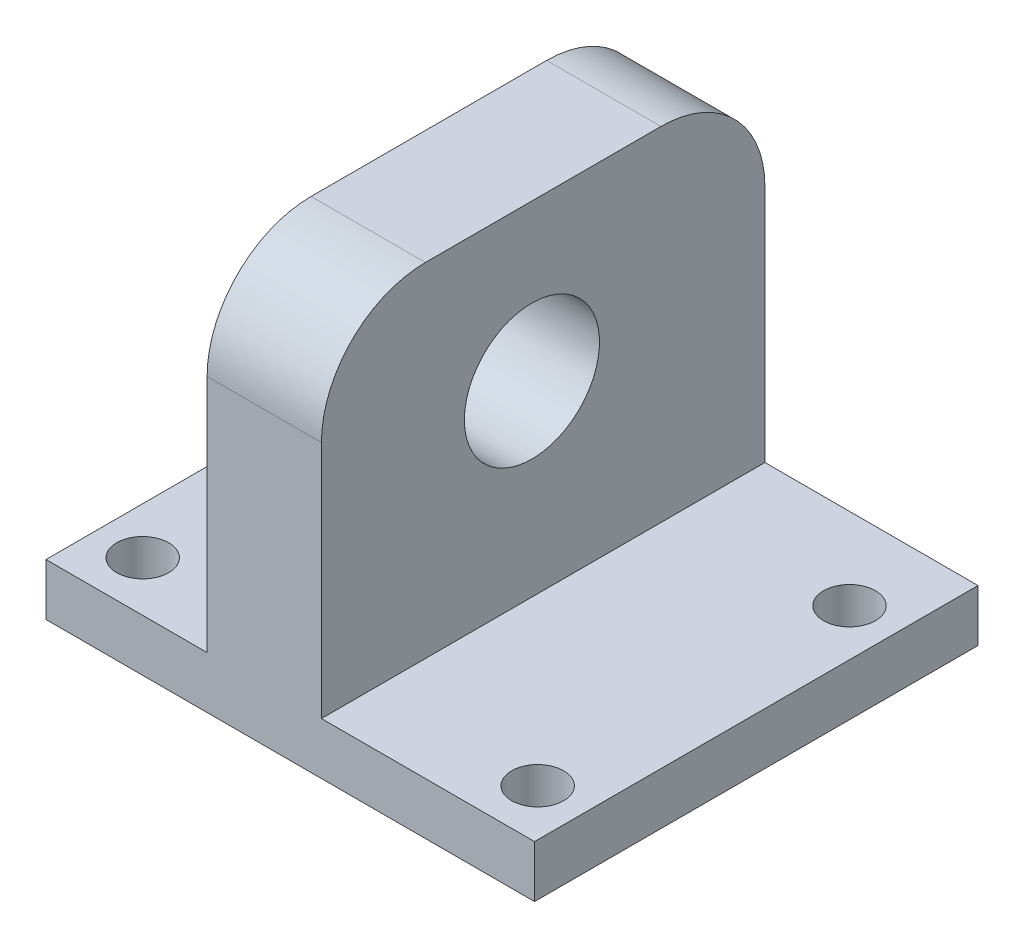
ISO-10303-21;
HEADER;
FILE_DESCRIPTION(('STEP AP214'),'2;1');
FILE_NAME('part.step','',(''),(''),'','','');
FILE_SCHEMA(('AUTOMOTIVE_DESIGN { 1 0 10303 214 1 1 1 1 }'));
ENDSEC;
DATA;
#1=APPLICATION_CONTEXT('core data for automotive mechanical design processes');
#2=APPLICATION_PROTOCOL_DEFINITION('international standard','automotive_design',2000,#1);
#3=PRODUCT_CONTEXT('',#1,'mechanical');
#4=PRODUCT('Part','Part','',(#3));
#5=PRODUCT_RELATED_PRODUCT_CATEGORY('part','',(#4));
#6=PRODUCT_DEFINITION_FORMATION('','',#4);
#7=PRODUCT_DEFINITION_CONTEXT('part definition',#1,'design');
#8=PRODUCT_DEFINITION('design','',#6,#7);
#9=PRODUCT_DEFINITION_SHAPE('','',#8);
#10=(LENGTH_UNIT() NAMED_UNIT(*) SI_UNIT(.MILLI.,.METRE.));
#11=(NAMED_UNIT(*) PLANE_ANGLE_UNIT() SI_UNIT($,.RADIAN.));
#12=(NAMED_UNIT(*) SI_UNIT($,.STERADIAN.) SOLID_ANGLE_UNIT());
#13=UNCERTAINTY_MEASURE_WITH_UNIT(LENGTH_MEASURE(1.E-05),#10,'distance_accuracy_value','');
#14=(GEOMETRIC_REPRESENTATION_CONTEXT(3) GLOBAL_UNCERTAINTY_ASSIGNED_CONTEXT((#13)) GLOBAL_UNIT_ASSIGNED_CONTEXT((#10,
#11,#12)) REPRESENTATION_CONTEXT('',''));
#15=CARTESIAN_POINT('',(0.,0.,0.));
#16=DIRECTION('',(0.,0.,1.));
#17=DIRECTION('',(1.,0.,0.));
#18=AXIS2_PLACEMENT_3D('',#15,#16,#17);
#19=CARTESIAN_POINT('',(0.,13.,0.));
#20=DIRECTION('',(0.,1.,0.));
#21=DIRECTION('',(0.,0.,1.));
#22=AXIS2_PLACEMENT_3D('',#19,#20,#21);
#23=PLANE('',#22);
#24=CARTESIAN_POINT('',(-10.,13.,-25.7045662951631));
#25=DIRECTION('',(0.,1.,0.));
#26=DIRECTION('',(0.,0.,1.));
#27=AXIS2_PLACEMENT_3D('',#24,#25,#26);
#28=CIRCLE('',#27,2.);
#29=CARTESIAN_POINT('',(-10.,13.,-27.7045662951631));
#30=VERTEX_POINT('',#29);
#31=CARTESIAN_POINT('',(-8.,13.,-25.7045662951631));
#32=VERTEX_POINT('',#31);
#33=EDGE_CURVE('E158',#30,#32,#28,.F.);
#34=ORIENTED_EDGE('',*,*,#33,.T.);
#35=DIRECTION('',(0.,0.,1.));
#36=VECTOR('',#35,1.);
#37=CARTESIAN_POINT('',(-8.,13.,-22.2925073687534));
#38=LINE('',#37,#36);
#39=CARTESIAN_POINT('',(-8.,13.,-29.7045662951631));
#40=VERTEX_POINT('',#39);
#41=EDGE_CURVE('E146',#40,#32,#38,.T.);
#42=ORIENTED_EDGE('',*,*,#41,.F.);
#43=DIRECTION('',(-1.,0.,0.));
#44=VECTOR('',#43,1.);
#45=CARTESIAN_POINT('',(0.,13.,-29.7045662951631));
#46=LINE('',#45,#44);
#47=CARTESIAN_POINT('',(-23.5,13.,-29.7045662951631));
#48=VERTEX_POINT('',#47);
#49=EDGE_CURVE('E154',#40,#48,#46,.T.);
#50=ORIENTED_EDGE('',*,*,#49,.T.);
#51=DIRECTION('',(0.,0.,-1.));
#52=VECTOR('',#51,1.);
#53=CARTESIAN_POINT('',(-23.5,13.,0.));
#54=LINE('',#53,#52);
#55=CARTESIAN_POINT('',(-23.5,13.,-27.7045662951631));
#56=VERTEX_POINT('',#55);
#57=EDGE_CURVE('E167',#56,#48,#54,.T.);
#58=ORIENTED_EDGE('',*,*,#57,.F.);
#59=DIRECTION('',(1.,0.,0.));
#60=VECTOR('',#59,1.);
#61=CARTESIAN_POINT('',(0.,13.,-27.7045662951631));
#62=LINE('',#61,#60);
#63=EDGE_CURVE('E172',#56,#30,#62,.T.);
#64=ORIENTED_EDGE('',*,*,#63,.T.);
#65=EDGE_LOOP('',(#34,#42,#50,#58,#64));
#66=FACE_BOUND('',#65,.T.);
#67=ADVANCED_FACE('F48',(#66),#23,.T.);
#68=CARTESIAN_POINT('',(0.,38.,-27.7045662951631));
#69=DIRECTION('',(0.,0.,-1.));
#70=DIRECTION('',(-1.,0.,0.));
#71=AXIS2_PLACEMENT_3D('',#68,#69,#70);
#72=PLANE('',#71);
#73=CARTESIAN_POINT('',(-16.6031759190852,9.,-27.7045662951631));
#74=DIRECTION('',(0.,0.,-1.));
#75=DIRECTION('',(-1.,0.,0.));
#76=AXIS2_PLACEMENT_3D('',#73,#74,#75);
#77=CIRCLE('',#76,2.);
#78=CARTESIAN_POINT('',(-18.6031759190852,9.,-27.7045662951631));
#79=VERTEX_POINT('',#78);
#80=EDGE_CURVE('E160',#79,#79,#77,.T.);
#81=ORIENTED_EDGE('',*,*,#80,.T.);
#82=EDGE_LOOP('',(#81));
#83=FACE_BOUND('',#82,.T.);
#84=DIRECTION('',(1.,0.,0.));
#85=VECTOR('',#84,1.);
#86=CARTESIAN_POINT('',(0.,5.,-27.7045662951631));
#87=LINE('',#86,#85);
#88=CARTESIAN_POINT('',(-23.5,5.,-27.7045662951631));
#89=VERTEX_POINT('',#88);
#90=CARTESIAN_POINT('',(-10.,5.,-27.7045662951631));
#91=VERTEX_POINT('',#90);
#92=EDGE_CURVE('E180',#89,#91,#87,.T.);
#93=ORIENTED_EDGE('',*,*,#92,.T.);
#94=DIRECTION('',(0.,-1.,0.));
#95=VECTOR('',#94,1.);
#96=CARTESIAN_POINT('',(-10.,13.,-27.7045662951631));
#97=LINE('',#96,#95);
#98=EDGE_CURVE('E243',#91,#30,#97,.F.);
#99=ORIENTED_EDGE('',*,*,#98,.T.);
#100=ORIENTED_EDGE('',*,*,#63,.F.);
#101=DIRECTION('',(0.,-1.,0.));
#102=VECTOR('',#101,1.);
#103=CARTESIAN_POINT('',(-23.5,38.,-27.7045662951631));
#104=LINE('',#103,#102);
#105=EDGE_CURVE('E186',#56,#89,#104,.T.);
#106=ORIENTED_EDGE('',*,*,#105,.T.);
#107=EDGE_LOOP('',(#93,#99,#100,#106));
#108=FACE_BOUND('',#107,.T.);
#109=ADVANCED_FACE('F299',(#83,#108),#72,.F.);
#110=CARTESIAN_POINT('',(0.,5.,0.));
#111=DIRECTION('',(0.,1.,0.));
#112=DIRECTION('',(0.,0.,1.));
#113=AXIS2_PLACEMENT_3D('',#110,#111,#112);
#114=PLANE('',#113);
#115=CARTESIAN_POINT('',(-19.,5.,-21.8424323695947));
#116=DIRECTION('',(0.,1.,0.));
#117=DIRECTION('',(0.,0.,1.));
#118=AXIS2_PLACEMENT_3D('',#115,#116,#117);
#119=CIRCLE('',#118,2.5);
#120=CARTESIAN_POINT('',(-19.,5.,-19.3424323695947));
#121=VERTEX_POINT('',#120);
#122=EDGE_CURVE('E199',#121,#121,#119,.T.);
#123=ORIENTED_EDGE('',*,*,#122,.F.);
#124=EDGE_LOOP('',(#123));
#125=FACE_BOUND('',#124,.T.);
#126=CARTESIAN_POINT('',(-19.,5.,8.15756763040534));
#127=DIRECTION('',(0.,1.,0.));
#128=DIRECTION('',(0.,0.,1.));
#129=AXIS2_PLACEMENT_3D('',#126,#127,#128);
#130=CIRCLE('',#129,2.5);
#131=CARTESIAN_POINT('',(-19.,5.,10.6575676304053));
#132=VERTEX_POINT('',#131);
#133=EDGE_CURVE('E192',#132,#132,#130,.T.);
#134=ORIENTED_EDGE('',*,*,#133,.F.);
#135=EDGE_LOOP('',(#134));
#136=FACE_BOUND('',#135,.T.);
#137=DIRECTION('',(0.,0.,1.));
#138=VECTOR('',#137,1.);
#139=CARTESIAN_POINT('',(-8.,5.,-27.7045662951631));
#140=LINE('',#139,#138);
#141=CARTESIAN_POINT('',(-8.,5.,-25.7045662951631));
#142=VERTEX_POINT('',#141);
#143=CARTESIAN_POINT('',(-8.,5.,12.9607154678039));
#144=VERTEX_POINT('',#143);
#145=EDGE_CURVE('E359',#142,#144,#140,.T.);
#146=ORIENTED_EDGE('',*,*,#145,.F.);
#147=CARTESIAN_POINT('',(-10.,5.,-25.7045662951631));
#148=DIRECTION('',(0.,1.,0.));
#149=DIRECTION('',(0.,0.,1.));
#150=AXIS2_PLACEMENT_3D('',#147,#148,#149);
#151=CIRCLE('',#150,2.);
#152=EDGE_CURVE('E241',#142,#91,#151,.T.);
#153=ORIENTED_EDGE('',*,*,#152,.T.);
#154=ORIENTED_EDGE('',*,*,#92,.F.);
#155=DIRECTION('',(0.,0.,-1.));
#156=VECTOR('',#155,1.);
#157=CARTESIAN_POINT('',(-23.5,5.,0.));
#158=LINE('',#157,#156);
#159=CARTESIAN_POINT('',(-23.5,5.,12.9607154678039));
#160=VERTEX_POINT('',#159);
#161=EDGE_CURVE('E202',#160,#89,#158,.T.);
#162=ORIENTED_EDGE('',*,*,#161,.F.);
#163=DIRECTION('',(-1.,0.,0.));
#164=VECTOR('',#163,1.);
#165=CARTESIAN_POINT('',(0.,5.,12.9607154678039));
#166=LINE('',#165,#164);
#167=EDGE_CURVE('E205',#144,#160,#166,.T.);
#168=ORIENTED_EDGE('',*,*,#167,.F.);
#169=EDGE_LOOP('',(#146,#153,#154,#162,#168));
#170=FACE_BOUND('',#169,.T.);
#171=ADVANCED_FACE('F304',(#125,#136,#170),#114,.T.);
#172=CARTESIAN_POINT('',(-23.5,5.,0.));
#173=DIRECTION('',(-1.,0.,0.));
#174=DIRECTION('',(0.,0.,1.));
#175=AXIS2_PLACEMENT_3D('',#172,#173,#174);
#176=PLANE('',#175);
#177=ORIENTED_EDGE('',*,*,#105,.F.);
#178=ORIENTED_EDGE('',*,*,#57,.T.);
#179=DIRECTION('',(0.,-1.,0.));
#180=VECTOR('',#179,1.);
#181=CARTESIAN_POINT('',(-23.5,5.,-29.7045662951631));
#182=LINE('',#181,#180);
#183=CARTESIAN_POINT('',(-23.5,0.,-29.7045662951631));
#184=VERTEX_POINT('',#183);
#185=EDGE_CURVE('E165',#48,#184,#182,.T.);
#186=ORIENTED_EDGE('',*,*,#185,.T.);
#187=DIRECTION('',(0.,0.,-1.));
#188=VECTOR('',#187,1.);
#189=CARTESIAN_POINT('',(-23.5,0.,0.));
#190=LINE('',#189,#188);
#191=CARTESIAN_POINT('',(-23.5,0.,12.9607154678039));
#192=VERTEX_POINT('',#191);
#193=EDGE_CURVE('E222',#192,#184,#190,.T.);
#194=ORIENTED_EDGE('',*,*,#193,.F.);
#195=DIRECTION('',(0.,-1.,0.));
#196=VECTOR('',#195,1.);
#197=CARTESIAN_POINT('',(-23.5,5.,12.9607154678039));
#198=LINE('',#197,#196);
#199=EDGE_CURVE('E237',#160,#192,#198,.T.);
#200=ORIENTED_EDGE('',*,*,#199,.F.);
#201=ORIENTED_EDGE('',*,*,#161,.T.);
#202=EDGE_LOOP('',(#177,#178,#186,#194,#200,#201));
#203=FACE_BOUND('',#202,.T.);
#204=ADVANCED_FACE('F330',(#203),#176,.T.);
#205=CARTESIAN_POINT('',(23.5,5.,0.));
#206=DIRECTION('',(-1.,0.,0.));
#207=DIRECTION('',(0.,0.,1.));
#208=AXIS2_PLACEMENT_3D('',#205,#206,#207);
#209=PLANE('',#208);
#210=DIRECTION('',(0.,-1.,0.));
#211=VECTOR('',#210,1.);
#212=CARTESIAN_POINT('',(23.5,5.,-29.7045662951631));
#213=LINE('',#212,#211);
#214=CARTESIAN_POINT('',(23.5,5.,-29.7045662951631));
#215=VERTEX_POINT('',#214);
#216=CARTESIAN_POINT('',(23.5,0.,-29.7045662951631));
#217=VERTEX_POINT('',#216);
#218=EDGE_CURVE('E233',#215,#217,#213,.T.);
#219=ORIENTED_EDGE('',*,*,#218,.F.);
#220=DIRECTION('',(0.,0.,-1.));
#221=VECTOR('',#220,1.);
#222=CARTESIAN_POINT('',(23.5,5.,0.));
#223=LINE('',#222,#221);
#224=CARTESIAN_POINT('',(23.5,5.,12.9607154678039));
#225=VERTEX_POINT('',#224);
#226=EDGE_CURVE('E209',#225,#215,#223,.T.);
#227=ORIENTED_EDGE('',*,*,#226,.F.);
#228=DIRECTION('',(0.,-1.,0.));
#229=VECTOR('',#228,1.);
#230=CARTESIAN_POINT('',(23.5,5.,12.9607154678039));
#231=LINE('',#230,#229);
#232=CARTESIAN_POINT('',(23.5,0.,12.9607154678039));
#233=VERTEX_POINT('',#232);
#234=EDGE_CURVE('E235',#225,#233,#231,.T.);
#235=ORIENTED_EDGE('',*,*,#234,.T.);
#236=DIRECTION('',(0.,0.,-1.));
#237=VECTOR('',#236,1.);
#238=CARTESIAN_POINT('',(23.5,0.,0.));
#239=LINE('',#238,#237);
#240=EDGE_CURVE('E228',#233,#217,#239,.T.);
#241=ORIENTED_EDGE('',*,*,#240,.T.);
#242=EDGE_LOOP('',(#219,#227,#235,#241));
#243=FACE_BOUND('',#242,.T.);
#244=ADVANCED_FACE('F326',(#243),#209,.F.);
#245=CARTESIAN_POINT('',(0.,5.,-29.7045662951631));
#246=DIRECTION('',(0.,0.,1.));
#247=DIRECTION('',(1.,0.,0.));
#248=AXIS2_PLACEMENT_3D('',#245,#246,#247);
#249=PLANE('',#248);
#250=CARTESIAN_POINT('',(-16.6031759190852,9.,-29.7045662951631));
#251=DIRECTION('',(0.,0.,-1.));
#252=DIRECTION('',(-1.,0.,0.));
#253=AXIS2_PLACEMENT_3D('',#250,#251,#252);
#254=CIRCLE('',#253,2.);
#255=CARTESIAN_POINT('',(-18.6031759190852,9.,-29.7045662951631));
#256=VERTEX_POINT('',#255);
#257=EDGE_CURVE('E381',#256,#256,#254,.T.);
#258=ORIENTED_EDGE('',*,*,#257,.F.);
#259=EDGE_LOOP('',(#258));
#260=FACE_BOUND('',#259,.T.);
#261=CARTESIAN_POINT('',(-2.5,14.3094116682529,-29.7045662951631));
#262=DIRECTION('',(0.,0.,-1.));
#263=DIRECTION('',(-1.,0.,0.));
#264=AXIS2_PLACEMENT_3D('',#261,#262,#263);
#265=CIRCLE('',#264,2.);
#266=CARTESIAN_POINT('',(-4.5,14.3094116682529,-29.7045662951631));
#267=VERTEX_POINT('',#266);
#268=EDGE_CURVE('E382',#267,#267,#265,.T.);
#269=ORIENTED_EDGE('',*,*,#268,.F.);
#270=EDGE_LOOP('',(#269));
#271=FACE_BOUND('',#270,.T.);
#272=DIRECTION('',(0.,-1.,0.));
#273=VECTOR('',#272,1.);
#274=CARTESIAN_POINT('',(-8.,38.,-29.7045662951631));
#275=LINE('',#274,#273);
#276=CARTESIAN_POINT('',(-8.,28.,-29.7045662951631));
#277=VERTEX_POINT('',#276);
#278=EDGE_CURVE('E141',#277,#40,#275,.T.);
#279=ORIENTED_EDGE('',*,*,#278,.F.);
#280=DIRECTION('',(-1.,0.,0.));
#281=VECTOR('',#280,1.);
#282=CARTESIAN_POINT('',(3.,28.,-29.7045662951631));
#283=LINE('',#282,#281);
#284=CARTESIAN_POINT('',(3.,28.,-29.7045662951631));
#285=VERTEX_POINT('',#284);
#286=EDGE_CURVE('E12',#277,#285,#283,.F.);
#287=ORIENTED_EDGE('',*,*,#286,.T.);
#288=DIRECTION('',(0.,-1.,0.));
#289=VECTOR('',#288,1.);
#290=CARTESIAN_POINT('',(3.,5.,-29.7045662951631));
#291=LINE('',#290,#289);
#292=CARTESIAN_POINT('',(3.,5.,-29.7045662951631));
#293=VERTEX_POINT('',#292);
#294=EDGE_CURVE('E267',#285,#293,#291,.T.);
#295=ORIENTED_EDGE('',*,*,#294,.T.);
#296=DIRECTION('',(1.,0.,0.));
#297=VECTOR('',#296,1.);
#298=CARTESIAN_POINT('',(0.,5.,-29.7045662951631));
#299=LINE('',#298,#297);
#300=EDGE_CURVE('E283',#293,#215,#299,.T.);
#301=ORIENTED_EDGE('',*,*,#300,.T.);
#302=ORIENTED_EDGE('',*,*,#218,.T.);
#303=DIRECTION('',(-1.,0.,0.));
#304=VECTOR('',#303,1.);
#305=CARTESIAN_POINT('',(0.,0.,-29.7045662951631));
#306=LINE('',#305,#304);
#307=EDGE_CURVE('E193',#217,#184,#306,.T.);
#308=ORIENTED_EDGE('',*,*,#307,.T.);
#309=ORIENTED_EDGE('',*,*,#185,.F.);
#310=ORIENTED_EDGE('',*,*,#49,.F.);
#311=EDGE_LOOP('',(#279,#287,#295,#301,#302,#308,#309,#310));
#312=FACE_BOUND('',#311,.T.);
#313=ADVANCED_FACE('F163',(#260,#271,#312),#249,.F.);
#314=CARTESIAN_POINT('',(0.,5.,12.9607154678039));
#315=DIRECTION('',(0.,0.,1.));
#316=DIRECTION('',(1.,0.,0.));
#317=AXIS2_PLACEMENT_3D('',#314,#315,#316);
#318=PLANE('',#317);
#319=DIRECTION('',(0.,-1.,0.));
#320=VECTOR('',#319,1.);
#321=CARTESIAN_POINT('',(3.,38.,12.9607154678039));
#322=LINE('',#321,#320);
#323=CARTESIAN_POINT('',(3.,28.,12.9607154678039));
#324=VERTEX_POINT('',#323);
#325=CARTESIAN_POINT('',(3.,5.,12.9607154678039));
#326=VERTEX_POINT('',#325);
#327=EDGE_CURVE('E179',#324,#326,#322,.T.);
#328=ORIENTED_EDGE('',*,*,#327,.F.);
#329=DIRECTION('',(1.,0.,0.));
#330=VECTOR('',#329,1.);
#331=CARTESIAN_POINT('',(0.,28.,12.9607154678039));
#332=LINE('',#331,#330);
#333=CARTESIAN_POINT('',(-8.,28.,12.9607154678039));
#334=VERTEX_POINT('',#333);
#335=EDGE_CURVE('E71',#324,#334,#332,.F.);
#336=ORIENTED_EDGE('',*,*,#335,.T.);
#337=DIRECTION('',(0.,1.,0.));
#338=VECTOR('',#337,1.);
#339=CARTESIAN_POINT('',(-8.,5.,12.9607154678039));
#340=LINE('',#339,#338);
#341=EDGE_CURVE('E260',#144,#334,#340,.T.);
#342=ORIENTED_EDGE('',*,*,#341,.F.);
#343=ORIENTED_EDGE('',*,*,#167,.T.);
#344=ORIENTED_EDGE('',*,*,#199,.T.);
#345=DIRECTION('',(-1.,0.,0.));
#346=VECTOR('',#345,1.);
#347=CARTESIAN_POINT('',(0.,0.,12.9607154678039));
#348=LINE('',#347,#346);
#349=EDGE_CURVE('E225',#233,#192,#348,.T.);
#350=ORIENTED_EDGE('',*,*,#349,.F.);
#351=ORIENTED_EDGE('',*,*,#234,.F.);
#352=EDGE_CURVE('E206',#225,#326,#166,.T.);
#353=ORIENTED_EDGE('',*,*,#352,.T.);
#354=EDGE_LOOP('',(#328,#336,#342,#343,#344,#350,#351,#353));
#355=FACE_BOUND('',#354,.T.);
#356=ADVANCED_FACE('F274',(#355),#318,.T.);
#357=CARTESIAN_POINT('',(-19.,5.,-21.8424323695947));
#358=DIRECTION('',(0.,-1.,0.));
#359=DIRECTION('',(0.,0.,-1.));
#360=AXIS2_PLACEMENT_3D('',#357,#358,#359);
#361=CYLINDRICAL_SURFACE('',#360,2.5);
#362=ORIENTED_EDGE('',*,*,#122,.T.);
#363=EDGE_LOOP('',(#362));
#364=FACE_BOUND('',#363,.T.);
#365=CARTESIAN_POINT('',(-19.,0.,-21.8424323695947));
#366=DIRECTION('',(0.,1.,0.));
#367=DIRECTION('',(0.,0.,1.));
#368=AXIS2_PLACEMENT_3D('',#365,#366,#367);
#369=CIRCLE('',#368,2.5);
#370=CARTESIAN_POINT('',(-19.,0.,-19.3424323695947));
#371=VERTEX_POINT('',#370);
#372=EDGE_CURVE('E219',#371,#371,#369,.T.);
#373=ORIENTED_EDGE('',*,*,#372,.F.);
#374=EDGE_LOOP('',(#373));
#375=FACE_BOUND('',#374,.T.);
#376=ADVANCED_FACE('F334',(#364,#375),#361,.F.);
#377=CARTESIAN_POINT('',(19.,5.,-21.8424323695946));
#378=DIRECTION('',(0.,-1.,0.));
#379=DIRECTION('',(0.,0.,-1.));
#380=AXIS2_PLACEMENT_3D('',#377,#378,#379);
#381=CYLINDRICAL_SURFACE('',#380,2.5);
#382=CARTESIAN_POINT('',(19.,5.,-21.8424323695946));
#383=DIRECTION('',(0.,1.,0.));
#384=DIRECTION('',(0.,0.,1.));
#385=AXIS2_PLACEMENT_3D('',#382,#383,#384);
#386=CIRCLE('',#385,2.5);
#387=CARTESIAN_POINT('',(19.,5.,-19.3424323695946));
#388=VERTEX_POINT('',#387);
#389=EDGE_CURVE('E196',#388,#388,#386,.T.);
#390=ORIENTED_EDGE('',*,*,#389,.T.);
#391=EDGE_LOOP('',(#390));
#392=FACE_BOUND('',#391,.T.);
#393=CARTESIAN_POINT('',(19.,0.,-21.8424323695946));
#394=DIRECTION('',(0.,1.,0.));
#395=DIRECTION('',(0.,0.,1.));
#396=AXIS2_PLACEMENT_3D('',#393,#394,#395);
#397=CIRCLE('',#396,2.5);
#398=CARTESIAN_POINT('',(19.,0.,-19.3424323695946));
#399=VERTEX_POINT('',#398);
#400=EDGE_CURVE('E216',#399,#399,#397,.T.);
#401=ORIENTED_EDGE('',*,*,#400,.F.);
#402=EDGE_LOOP('',(#401));
#403=FACE_BOUND('',#402,.T.);
#404=ADVANCED_FACE('F340',(#392,#403),#381,.F.);
#405=CARTESIAN_POINT('',(-19.,5.,8.15756763040534));
#406=DIRECTION('',(0.,-1.,0.));
#407=DIRECTION('',(0.,0.,-1.));
#408=AXIS2_PLACEMENT_3D('',#405,#406,#407);
#409=CYLINDRICAL_SURFACE('',#408,2.5);
#410=ORIENTED_EDGE('',*,*,#133,.T.);
#411=EDGE_LOOP('',(#410));
#412=FACE_BOUND('',#411,.T.);
#413=CARTESIAN_POINT('',(-19.,0.,8.15756763040534));
#414=DIRECTION('',(0.,1.,0.));
#415=DIRECTION('',(0.,0.,1.));
#416=AXIS2_PLACEMENT_3D('',#413,#414,#415);
#417=CIRCLE('',#416,2.5);
#418=CARTESIAN_POINT('',(-19.,0.,10.6575676304053));
#419=VERTEX_POINT('',#418);
#420=EDGE_CURVE('E213',#419,#419,#417,.T.);
#421=ORIENTED_EDGE('',*,*,#420,.F.);
#422=EDGE_LOOP('',(#421));
#423=FACE_BOUND('',#422,.T.);
#424=ADVANCED_FACE('F344',(#412,#423),#409,.F.);
#425=CARTESIAN_POINT('',(19.,5.,8.15756763040534));
#426=DIRECTION('',(0.,-1.,0.));
#427=DIRECTION('',(0.,0.,-1.));
#428=AXIS2_PLACEMENT_3D('',#425,#426,#427);
#429=CYLINDRICAL_SURFACE('',#428,2.5);
#430=CARTESIAN_POINT('',(19.,5.,8.15756763040534));
#431=DIRECTION('',(0.,1.,0.));
#432=DIRECTION('',(0.,0.,1.));
#433=AXIS2_PLACEMENT_3D('',#430,#431,#432);
#434=CIRCLE('',#433,2.5);
#435=CARTESIAN_POINT('',(19.,5.,10.6575676304053));
#436=VERTEX_POINT('',#435);
#437=EDGE_CURVE('E189',#436,#436,#434,.T.);
#438=ORIENTED_EDGE('',*,*,#437,.T.);
#439=EDGE_LOOP('',(#438));
#440=FACE_BOUND('',#439,.T.);
#441=CARTESIAN_POINT('',(19.,0.,8.15756763040534));
#442=DIRECTION('',(0.,1.,0.));
#443=DIRECTION('',(0.,0.,1.));
#444=AXIS2_PLACEMENT_3D('',#441,#442,#443);
#445=CIRCLE('',#444,2.5);
#446=CARTESIAN_POINT('',(19.,0.,10.6575676304053));
#447=VERTEX_POINT('',#446);
#448=EDGE_CURVE('E188',#447,#447,#445,.T.);
#449=ORIENTED_EDGE('',*,*,#448,.F.);
#450=EDGE_LOOP('',(#449));
#451=FACE_BOUND('',#450,.T.);
#452=ADVANCED_FACE('F320',(#440,#451),#429,.F.);
#453=DIRECTION('',(0.,0.,-1.));
#454=VECTOR('',#453,1.);
#455=CARTESIAN_POINT('',(3.,5.,0.));
#456=LINE('',#455,#454);
#457=EDGE_CURVE('E170',#326,#293,#456,.T.);
#458=ORIENTED_EDGE('',*,*,#457,.F.);
#459=ORIENTED_EDGE('',*,*,#352,.F.);
#460=ORIENTED_EDGE('',*,*,#226,.T.);
#461=ORIENTED_EDGE('',*,*,#300,.F.);
#462=EDGE_LOOP('',(#458,#459,#460,#461));
#463=FACE_BOUND('',#462,.T.);
#464=ORIENTED_EDGE('',*,*,#437,.F.);
#465=EDGE_LOOP('',(#464));
#466=FACE_BOUND('',#465,.T.);
#467=ORIENTED_EDGE('',*,*,#389,.F.);
#468=EDGE_LOOP('',(#467));
#469=FACE_BOUND('',#468,.T.);
#470=ADVANCED_FACE('F279',(#463,#466,#469),#114,.T.);
#471=CARTESIAN_POINT('',(0.,0.,0.));
#472=DIRECTION('',(0.,1.,0.));
#473=DIRECTION('',(0.,0.,1.));
#474=AXIS2_PLACEMENT_3D('',#471,#472,#473);
#475=PLANE('',#474);
#476=ORIENTED_EDGE('',*,*,#448,.T.);
#477=EDGE_LOOP('',(#476));
#478=FACE_BOUND('',#477,.T.);
#479=ORIENTED_EDGE('',*,*,#420,.T.);
#480=EDGE_LOOP('',(#479));
#481=FACE_BOUND('',#480,.T.);
#482=ORIENTED_EDGE('',*,*,#400,.T.);
#483=EDGE_LOOP('',(#482));
#484=FACE_BOUND('',#483,.T.);
#485=ORIENTED_EDGE('',*,*,#372,.T.);
#486=EDGE_LOOP('',(#485));
#487=FACE_BOUND('',#486,.T.);
#488=ORIENTED_EDGE('',*,*,#193,.T.);
#489=ORIENTED_EDGE('',*,*,#307,.F.);
#490=ORIENTED_EDGE('',*,*,#240,.F.);
#491=ORIENTED_EDGE('',*,*,#349,.T.);
#492=EDGE_LOOP('',(#488,#489,#490,#491));
#493=FACE_BOUND('',#492,.T.);
#494=ADVANCED_FACE('F317',(#478,#481,#484,#487,#493),#475,.F.);
#495=CARTESIAN_POINT('',(3.,38.,0.));
#496=DIRECTION('',(-1.,0.,0.));
#497=DIRECTION('',(0.,0.,1.));
#498=AXIS2_PLACEMENT_3D('',#495,#496,#497);
#499=PLANE('',#498);
#500=DIRECTION('',(0.,0.,-1.));
#501=VECTOR('',#500,1.);
#502=CARTESIAN_POINT('',(3.,38.,0.));
#503=LINE('',#502,#501);
#504=CARTESIAN_POINT('',(3.,38.,2.96071546780391));
#505=VERTEX_POINT('',#504);
#506=CARTESIAN_POINT('',(3.,38.,-19.7045662951631));
#507=VERTEX_POINT('',#506);
#508=EDGE_CURVE('E176',#505,#507,#503,.T.);
#509=ORIENTED_EDGE('',*,*,#508,.F.);
#510=CARTESIAN_POINT('',(3.,28.,2.96071546780391));
#511=DIRECTION('',(-1.,0.,0.));
#512=DIRECTION('',(0.,0.,1.));
#513=AXIS2_PLACEMENT_3D('',#510,#511,#512);
#514=CIRCLE('',#513,10.);
#515=EDGE_CURVE('E254',#505,#324,#514,.F.);
#516=ORIENTED_EDGE('',*,*,#515,.T.);
#517=ORIENTED_EDGE('',*,*,#327,.T.);
#518=ORIENTED_EDGE('',*,*,#457,.T.);
#519=ORIENTED_EDGE('',*,*,#294,.F.);
#520=CARTESIAN_POINT('',(3.,28.,-19.7045662951631));
#521=DIRECTION('',(-1.,0.,0.));
#522=DIRECTION('',(0.,0.,1.));
#523=AXIS2_PLACEMENT_3D('',#520,#521,#522);
#524=CIRCLE('',#523,10.);
#525=EDGE_CURVE('E252',#285,#507,#524,.F.);
#526=ORIENTED_EDGE('',*,*,#525,.T.);
#527=EDGE_LOOP('',(#509,#516,#517,#518,#519,#526));
#528=FACE_BOUND('',#527,.T.);
#529=CARTESIAN_POINT('',(3.,22.9956029714957,-7.28945850344098));
#530=DIRECTION('',(-1.,0.,0.));
#531=DIRECTION('',(0.,0.,1.));
#532=AXIS2_PLACEMENT_3D('',#529,#530,#531);
#533=CIRCLE('',#532,6.5);
#534=CARTESIAN_POINT('',(3.,22.9956029714957,-0.789458503440981));
#535=VERTEX_POINT('',#534);
#536=EDGE_CURVE('E166',#535,#535,#533,.T.);
#537=ORIENTED_EDGE('',*,*,#536,.T.);
#538=EDGE_LOOP('',(#537));
#539=FACE_BOUND('',#538,.T.);
#540=ADVANCED_FACE('F271',(#528,#539),#499,.F.);
#541=CARTESIAN_POINT('',(0.,38.,0.));
#542=DIRECTION('',(0.,1.,0.));
#543=DIRECTION('',(0.,0.,1.));
#544=AXIS2_PLACEMENT_3D('',#541,#542,#543);
#545=PLANE('',#544);
#546=DIRECTION('',(0.,0.,-1.));
#547=VECTOR('',#546,1.);
#548=CARTESIAN_POINT('',(-8.,38.,12.9607154678039));
#549=LINE('',#548,#547);
#550=CARTESIAN_POINT('',(-8.,38.,2.96071546780391));
#551=VERTEX_POINT('',#550);
#552=CARTESIAN_POINT('',(-8.,38.,-19.7045662951631));
#553=VERTEX_POINT('',#552);
#554=EDGE_CURVE('E259',#551,#553,#549,.T.);
#555=ORIENTED_EDGE('',*,*,#554,.F.);
#556=DIRECTION('',(1.,0.,0.));
#557=VECTOR('',#556,1.);
#558=CARTESIAN_POINT('',(0.,38.,2.96071546780391));
#559=LINE('',#558,#557);
#560=EDGE_CURVE('E249',#551,#505,#559,.T.);
#561=ORIENTED_EDGE('',*,*,#560,.T.);
#562=ORIENTED_EDGE('',*,*,#508,.T.);
#563=DIRECTION('',(-1.,0.,0.));
#564=VECTOR('',#563,1.);
#565=CARTESIAN_POINT('',(-8.,38.,-19.7045662951631));
#566=LINE('',#565,#564);
#567=EDGE_CURVE('E246',#507,#553,#566,.T.);
#568=ORIENTED_EDGE('',*,*,#567,.T.);
#569=EDGE_LOOP('',(#555,#561,#562,#568));
#570=FACE_BOUND('',#569,.T.);
#571=ADVANCED_FACE('F264',(#570),#545,.T.);
#572=CARTESIAN_POINT('',(4.,22.9956029714957,-7.28945850344098));
#573=DIRECTION('',(-1.,0.,0.));
#574=DIRECTION('',(0.,0.,1.));
#575=AXIS2_PLACEMENT_3D('',#572,#573,#574);
#576=CYLINDRICAL_SURFACE('',#575,6.5);
#577=ORIENTED_EDGE('',*,*,#536,.F.);
#578=EDGE_LOOP('',(#577));
#579=FACE_BOUND('',#578,.T.);
#580=CARTESIAN_POINT('',(-8.,22.9956029714957,-7.28945850344098));
#581=DIRECTION('',(-1.,0.,0.));
#582=DIRECTION('',(0.,0.,1.));
#583=AXIS2_PLACEMENT_3D('',#580,#581,#582);
#584=CIRCLE('',#583,6.5);
#585=CARTESIAN_POINT('',(-8.,22.9956029714957,-0.789458503440981));
#586=VERTEX_POINT('',#585);
#587=EDGE_CURVE('E151',#586,#586,#584,.T.);
#588=ORIENTED_EDGE('',*,*,#587,.T.);
#589=EDGE_LOOP('',(#588));
#590=FACE_BOUND('',#589,.T.);
#591=ADVANCED_FACE('F309',(#579,#590),#576,.F.);
#592=CARTESIAN_POINT('',(-8.,0.,0.));
#593=DIRECTION('',(1.,0.,0.));
#594=DIRECTION('',(0.,0.,-1.));
#595=AXIS2_PLACEMENT_3D('',#592,#593,#594);
#596=PLANE('',#595);
#597=ORIENTED_EDGE('',*,*,#341,.T.);
#598=CARTESIAN_POINT('',(-8.,28.,2.96071546780391));
#599=DIRECTION('',(1.,0.,0.));
#600=DIRECTION('',(0.,0.,-1.));
#601=AXIS2_PLACEMENT_3D('',#598,#599,#600);
#602=CIRCLE('',#601,10.);
#603=EDGE_CURVE('E56',#334,#551,#602,.F.);
#604=ORIENTED_EDGE('',*,*,#603,.T.);
#605=ORIENTED_EDGE('',*,*,#554,.T.);
#606=CARTESIAN_POINT('',(-8.,28.,-19.7045662951631));
#607=DIRECTION('',(1.,0.,0.));
#608=DIRECTION('',(0.,0.,-1.));
#609=AXIS2_PLACEMENT_3D('',#606,#607,#608);
#610=CIRCLE('',#609,10.);
#611=EDGE_CURVE('E63',#553,#277,#610,.F.);
#612=ORIENTED_EDGE('',*,*,#611,.T.);
#613=ORIENTED_EDGE('',*,*,#278,.T.);
#614=ORIENTED_EDGE('',*,*,#41,.T.);
#615=DIRECTION('',(0.,-1.,0.));
#616=VECTOR('',#615,1.);
#617=CARTESIAN_POINT('',(-8.,5.,-25.7045662951631));
#618=LINE('',#617,#616);
#619=EDGE_CURVE('E239',#32,#142,#618,.T.);
#620=ORIENTED_EDGE('',*,*,#619,.T.);
#621=ORIENTED_EDGE('',*,*,#145,.T.);
#622=EDGE_LOOP('',(#597,#604,#605,#612,#613,#614,#620,#621));
#623=FACE_BOUND('',#622,.T.);
#624=ORIENTED_EDGE('',*,*,#587,.F.);
#625=EDGE_LOOP('',(#624));
#626=FACE_BOUND('',#625,.T.);
#627=ADVANCED_FACE('F143',(#623,#626),#596,.F.);
#628=CARTESIAN_POINT('',(-10.,0.,-25.7045662951631));
#629=DIRECTION('',(0.,1.,0.));
#630=DIRECTION('',(0.,0.,1.));
#631=AXIS2_PLACEMENT_3D('',#628,#629,#630);
#632=CYLINDRICAL_SURFACE('',#631,2.);
#633=ORIENTED_EDGE('',*,*,#33,.F.);
#634=ORIENTED_EDGE('',*,*,#98,.F.);
#635=ORIENTED_EDGE('',*,*,#152,.F.);
#636=ORIENTED_EDGE('',*,*,#619,.F.);
#637=EDGE_LOOP('',(#633,#634,#635,#636));
#638=FACE_BOUND('',#637,.T.);
#639=ADVANCED_FACE('F297',(#638),#632,.F.);
#640=CARTESIAN_POINT('',(0.,28.,2.96071546780391));
#641=DIRECTION('',(1.,0.,0.));
#642=DIRECTION('',(0.,0.,-1.));
#643=AXIS2_PLACEMENT_3D('',#640,#641,#642);
#644=CYLINDRICAL_SURFACE('',#643,10.);
#645=ORIENTED_EDGE('',*,*,#603,.F.);
#646=ORIENTED_EDGE('',*,*,#335,.F.);
#647=ORIENTED_EDGE('',*,*,#515,.F.);
#648=ORIENTED_EDGE('',*,*,#560,.F.);
#649=EDGE_LOOP('',(#645,#646,#647,#648));
#650=FACE_BOUND('',#649,.T.);
#651=ADVANCED_FACE('F269',(#650),#644,.T.);
#652=CARTESIAN_POINT('',(0.,28.,-19.7045662951631));
#653=DIRECTION('',(1.,0.,0.));
#654=DIRECTION('',(0.,0.,-1.));
#655=AXIS2_PLACEMENT_3D('',#652,#653,#654);
#656=CYLINDRICAL_SURFACE('',#655,10.);
#657=ORIENTED_EDGE('',*,*,#525,.F.);
#658=ORIENTED_EDGE('',*,*,#286,.F.);
#659=ORIENTED_EDGE('',*,*,#611,.F.);
#660=ORIENTED_EDGE('',*,*,#567,.F.);
#661=EDGE_LOOP('',(#657,#658,#659,#660));
#662=FACE_BOUND('',#661,.T.);
#663=ADVANCED_FACE('F50',(#662),#656,.T.);
#664=CARTESIAN_POINT('',(-2.5,14.3094116682529,-25.7045662951631));
#665=DIRECTION('',(0.,0.,-1.));
#666=DIRECTION('',(-1.,0.,0.));
#667=AXIS2_PLACEMENT_3D('',#664,#665,#666);
#668=CYLINDRICAL_SURFACE('',#667,2.);
#669=CARTESIAN_POINT('',(-2.5,14.3094116682529,-25.7045662951631));
#670=DIRECTION('',(0.,0.,-1.));
#671=DIRECTION('',(-1.,0.,0.));
#672=AXIS2_PLACEMENT_3D('',#669,#670,#671);
#673=CIRCLE('',#672,2.);
#674=CARTESIAN_POINT('',(-4.5,14.3094116682529,-25.7045662951631));
#675=VERTEX_POINT('',#674);
#676=EDGE_CURVE('E385',#675,#675,#673,.T.);
#677=ORIENTED_EDGE('',*,*,#676,.F.);
#678=EDGE_LOOP('',(#677));
#679=FACE_BOUND('',#678,.T.);
#680=ORIENTED_EDGE('',*,*,#268,.T.);
#681=EDGE_LOOP('',(#680));
#682=FACE_BOUND('',#681,.T.);
#683=ADVANCED_FACE('F289',(#679,#682),#668,.F.);
#684=CARTESIAN_POINT('',(0.,0.,-25.7045662951631));
#685=DIRECTION('',(0.,0.,-1.));
#686=DIRECTION('',(-1.,0.,0.));
#687=AXIS2_PLACEMENT_3D('',#684,#685,#686);
#688=PLANE('',#687);
#689=ORIENTED_EDGE('',*,*,#676,.T.);
#690=EDGE_LOOP('',(#689));
#691=FACE_BOUND('',#690,.T.);
#692=ADVANCED_FACE('F294',(#691),#688,.T.);
#693=CARTESIAN_POINT('',(-16.6031759190852,9.,-25.7045662951631));
#694=DIRECTION('',(0.,0.,-1.));
#695=DIRECTION('',(-1.,0.,0.));
#696=AXIS2_PLACEMENT_3D('',#693,#694,#695);
#697=CYLINDRICAL_SURFACE('',#696,2.);
#698=ORIENTED_EDGE('',*,*,#257,.T.);
#699=EDGE_LOOP('',(#698));
#700=FACE_BOUND('',#699,.T.);
#701=ORIENTED_EDGE('',*,*,#80,.F.);
#702=EDGE_LOOP('',(#701));
#703=FACE_BOUND('',#702,.T.);
#704=ADVANCED_FACE('F391',(#700,#703),#697,.F.);
#705=CLOSED_SHELL('',(#67,#109,#171,#204,#244,#313,#356,#376,#404,#424,#452,#470,#494,#540,#571,
#591,#627,#639,#651,#663,#683,#692,#704));
#706=MANIFOLD_SOLID_BREP('B2',#705);
#707=ADVANCED_BREP_SHAPE_REPRESENTATION('',(#18,#706),#14);
#708=SHAPE_DEFINITION_REPRESENTATION(#9,#707);
ENDSEC;
END-ISO-10303-21;
